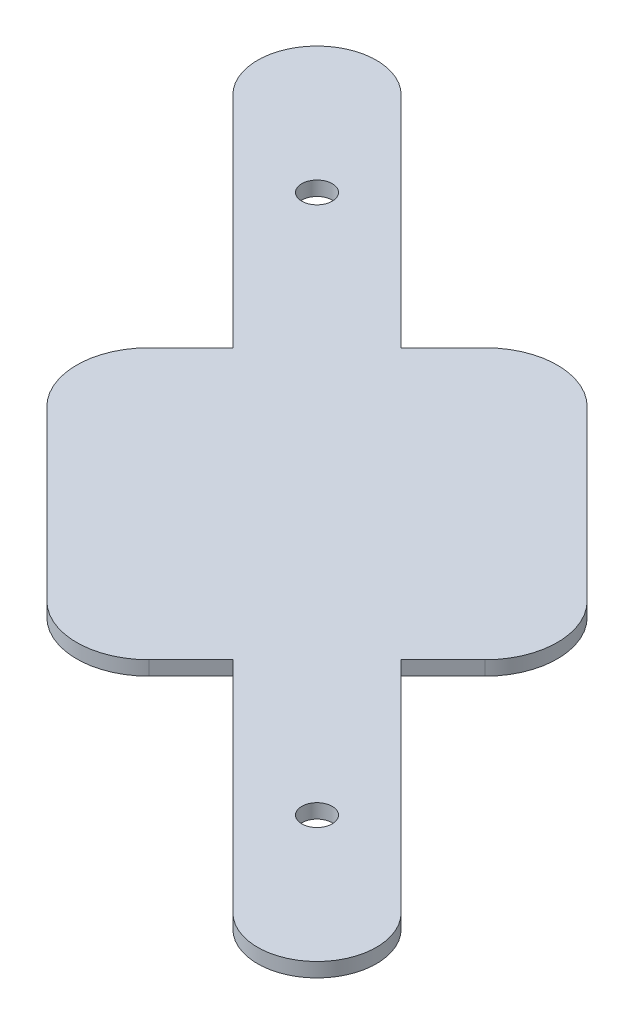
ISO-10303-21;
HEADER;
FILE_DESCRIPTION(('STEP AP214'),'2;1');
FILE_NAME('part.step','',(''),(''),'','','');
FILE_SCHEMA(('AUTOMOTIVE_DESIGN { 1 0 10303 214 1 1 1 1 }'));
ENDSEC;
DATA;
#1=APPLICATION_CONTEXT('core data for automotive mechanical design processes');
#2=APPLICATION_PROTOCOL_DEFINITION('international standard','automotive_design',2000,#1);
#3=PRODUCT_CONTEXT('',#1,'mechanical');
#4=PRODUCT('Part','Part','',(#3));
#5=PRODUCT_RELATED_PRODUCT_CATEGORY('part','',(#4));
#6=PRODUCT_DEFINITION_FORMATION('','',#4);
#7=PRODUCT_DEFINITION_CONTEXT('part definition',#1,'design');
#8=PRODUCT_DEFINITION('design','',#6,#7);
#9=PRODUCT_DEFINITION_SHAPE('','',#8);
#10=(LENGTH_UNIT() NAMED_UNIT(*) SI_UNIT(.MILLI.,.METRE.));
#11=(NAMED_UNIT(*) PLANE_ANGLE_UNIT() SI_UNIT($,.RADIAN.));
#12=(NAMED_UNIT(*) SI_UNIT($,.STERADIAN.) SOLID_ANGLE_UNIT());
#13=UNCERTAINTY_MEASURE_WITH_UNIT(LENGTH_MEASURE(1.E-05),#10,'distance_accuracy_value','');
#14=(GEOMETRIC_REPRESENTATION_CONTEXT(3) GLOBAL_UNCERTAINTY_ASSIGNED_CONTEXT((#13)) GLOBAL_UNIT_ASSIGNED_CONTEXT((#10,
#11,#12)) REPRESENTATION_CONTEXT('',''));
#15=CARTESIAN_POINT('',(0.,0.,0.));
#16=DIRECTION('',(0.,0.,1.));
#17=DIRECTION('',(1.,0.,0.));
#18=AXIS2_PLACEMENT_3D('',#15,#16,#17);
#19=CARTESIAN_POINT('',(-28.3968528922178,3.,-28.3968528922178));
#20=DIRECTION('',(-0.707106781186548,0.,-0.707106781186547));
#21=DIRECTION('',(-0.707106781186547,0.,0.707106781186548));
#22=AXIS2_PLACEMENT_3D('',#19,#20,#21);
#23=PLANE('',#22);
#24=DIRECTION('',(0.707106781186547,0.,-0.707106781186548));
#25=VECTOR('',#24,1.);
#26=CARTESIAN_POINT('',(-28.3968528922178,0.,-28.3968528922178));
#27=LINE('',#26,#25);
#28=CARTESIAN_POINT('',(-46.0745224218814,0.,-10.7191833625541));
#29=VERTEX_POINT('',#28);
#30=CARTESIAN_POINT('',(-37.2356876570496,0.,-19.5580181273859));
#31=VERTEX_POINT('',#30);
#32=EDGE_CURVE('E182',#29,#31,#27,.T.);
#33=ORIENTED_EDGE('',*,*,#32,.F.);
#34=DIRECTION('',(0.,-1.,0.));
#35=VECTOR('',#34,1.);
#36=CARTESIAN_POINT('',(-46.0745224218814,3.,-10.7191833625541));
#37=LINE('',#36,#35);
#38=CARTESIAN_POINT('',(-46.0745224218814,3.,-10.7191833625541));
#39=VERTEX_POINT('',#38);
#40=EDGE_CURVE('E11',#39,#29,#37,.T.);
#41=ORIENTED_EDGE('',*,*,#40,.F.);
#42=DIRECTION('',(0.707106781186547,0.,-0.707106781186548));
#43=VECTOR('',#42,1.);
#44=CARTESIAN_POINT('',(-28.3968528922178,3.,-28.3968528922178));
#45=LINE('',#44,#43);
#46=CARTESIAN_POINT('',(-37.2356876570496,3.,-19.5580181273859));
#47=VERTEX_POINT('',#46);
#48=EDGE_CURVE('E515',#39,#47,#45,.T.);
#49=ORIENTED_EDGE('',*,*,#48,.T.);
#50=DIRECTION('',(0.,-1.,0.));
#51=VECTOR('',#50,1.);
#52=CARTESIAN_POINT('',(-37.2356876570496,3.,-19.5580181273859));
#53=LINE('',#52,#51);
#54=EDGE_CURVE('E49',#47,#31,#53,.T.);
#55=ORIENTED_EDGE('',*,*,#54,.T.);
#56=EDGE_LOOP('',(#33,#41,#49,#55));
#57=FACE_BOUND('',#56,.T.);
#58=ADVANCED_FACE('F32',(#57),#23,.T.);
#59=CARTESIAN_POINT('',(-35.3553390593273,3.,0.));
#60=DIRECTION('',(0.,-1.,0.));
#61=DIRECTION('',(0.,0.,-1.));
#62=AXIS2_PLACEMENT_3D('',#59,#60,#61);
#63=CYLINDRICAL_SURFACE('',#62,15.159214488888);
#64=CARTESIAN_POINT('',(-35.3553390593273,0.,0.));
#65=DIRECTION('',(0.,1.,0.));
#66=DIRECTION('',(0.,0.,1.));
#67=AXIS2_PLACEMENT_3D('',#64,#65,#66);
#68=CIRCLE('',#67,15.159214488888);
#69=CARTESIAN_POINT('',(-46.0745224218814,0.,10.7191833625541));
#70=VERTEX_POINT('',#69);
#71=EDGE_CURVE('E184',#29,#70,#68,.T.);
#72=ORIENTED_EDGE('',*,*,#71,.T.);
#73=DIRECTION('',(0.,-1.,0.));
#74=VECTOR('',#73,1.);
#75=CARTESIAN_POINT('',(-46.0745224218814,3.,10.7191833625541));
#76=LINE('',#75,#74);
#77=CARTESIAN_POINT('',(-46.0745224218814,3.,10.7191833625541));
#78=VERTEX_POINT('',#77);
#79=EDGE_CURVE('E41',#78,#70,#76,.T.);
#80=ORIENTED_EDGE('',*,*,#79,.F.);
#81=CARTESIAN_POINT('',(-35.3553390593273,3.,0.));
#82=DIRECTION('',(0.,1.,0.));
#83=DIRECTION('',(0.,0.,1.));
#84=AXIS2_PLACEMENT_3D('',#81,#82,#83);
#85=CIRCLE('',#84,15.159214488888);
#86=EDGE_CURVE('E482',#39,#78,#85,.T.);
#87=ORIENTED_EDGE('',*,*,#86,.F.);
#88=ORIENTED_EDGE('',*,*,#40,.T.);
#89=EDGE_LOOP('',(#72,#80,#87,#88));
#90=FACE_BOUND('',#89,.T.);
#91=ADVANCED_FACE('F262',(#90),#63,.T.);
#92=CARTESIAN_POINT('',(-28.3968528922177,3.,28.3968528922178));
#93=DIRECTION('',(0.707106781186547,0.,-0.707106781186548));
#94=DIRECTION('',(-0.707106781186548,0.,-0.707106781186547));
#95=AXIS2_PLACEMENT_3D('',#92,#93,#94);
#96=PLANE('',#95);
#97=DIRECTION('',(0.707106781186548,0.,0.707106781186547));
#98=VECTOR('',#97,1.);
#99=CARTESIAN_POINT('',(-28.3968528922177,0.,28.3968528922178));
#100=LINE('',#99,#98);
#101=CARTESIAN_POINT('',(-10.719183362554,0.,46.0745224218814));
#102=VERTEX_POINT('',#101);
#103=EDGE_CURVE('E187',#70,#102,#100,.T.);
#104=ORIENTED_EDGE('',*,*,#103,.T.);
#105=DIRECTION('',(0.,-1.,0.));
#106=VECTOR('',#105,1.);
#107=CARTESIAN_POINT('',(-10.719183362554,3.,46.0745224218814));
#108=LINE('',#107,#106);
#109=CARTESIAN_POINT('',(-10.719183362554,3.,46.0745224218814));
#110=VERTEX_POINT('',#109);
#111=EDGE_CURVE('E250',#110,#102,#108,.T.);
#112=ORIENTED_EDGE('',*,*,#111,.F.);
#113=DIRECTION('',(0.707106781186548,0.,0.707106781186547));
#114=VECTOR('',#113,1.);
#115=CARTESIAN_POINT('',(-28.3968528922177,3.,28.3968528922178));
#116=LINE('',#115,#114);
#117=EDGE_CURVE('E258',#78,#110,#116,.T.);
#118=ORIENTED_EDGE('',*,*,#117,.F.);
#119=ORIENTED_EDGE('',*,*,#79,.T.);
#120=EDGE_LOOP('',(#104,#112,#118,#119));
#121=FACE_BOUND('',#120,.T.);
#122=ADVANCED_FACE('F255',(#121),#96,.F.);
#123=CARTESIAN_POINT('',(0.,3.,35.3553390593274));
#124=DIRECTION('',(0.,-1.,0.));
#125=DIRECTION('',(0.,0.,-1.));
#126=AXIS2_PLACEMENT_3D('',#123,#124,#125);
#127=CYLINDRICAL_SURFACE('',#126,15.159214488888);
#128=CARTESIAN_POINT('',(0.,0.,35.3553390593274));
#129=DIRECTION('',(0.,1.,0.));
#130=DIRECTION('',(0.,0.,1.));
#131=AXIS2_PLACEMENT_3D('',#128,#129,#130);
#132=CIRCLE('',#131,15.159214488888);
#133=CARTESIAN_POINT('',(10.7191833625541,0.,46.0745224218814));
#134=VERTEX_POINT('',#133);
#135=EDGE_CURVE('E190',#102,#134,#132,.T.);
#136=ORIENTED_EDGE('',*,*,#135,.T.);
#137=DIRECTION('',(0.,-1.,0.));
#138=VECTOR('',#137,1.);
#139=CARTESIAN_POINT('',(10.7191833625541,3.,46.0745224218814));
#140=LINE('',#139,#138);
#141=CARTESIAN_POINT('',(10.7191833625541,3.,46.0745224218814));
#142=VERTEX_POINT('',#141);
#143=EDGE_CURVE('E247',#142,#134,#140,.T.);
#144=ORIENTED_EDGE('',*,*,#143,.F.);
#145=CARTESIAN_POINT('',(0.,3.,35.3553390593274));
#146=DIRECTION('',(0.,1.,0.));
#147=DIRECTION('',(0.,0.,1.));
#148=AXIS2_PLACEMENT_3D('',#145,#146,#147);
#149=CIRCLE('',#148,15.159214488888);
#150=EDGE_CURVE('E479',#110,#142,#149,.T.);
#151=ORIENTED_EDGE('',*,*,#150,.F.);
#152=ORIENTED_EDGE('',*,*,#111,.T.);
#153=EDGE_LOOP('',(#136,#144,#151,#152));
#154=FACE_BOUND('',#153,.T.);
#155=ADVANCED_FACE('F337',(#154),#127,.T.);
#156=CARTESIAN_POINT('',(28.3968528922177,3.,28.3968528922178));
#157=DIRECTION('',(-0.707106781186547,0.,-0.707106781186548));
#158=DIRECTION('',(-0.707106781186548,0.,0.707106781186547));
#159=AXIS2_PLACEMENT_3D('',#156,#157,#158);
#160=PLANE('',#159);
#161=DIRECTION('',(0.707106781186548,0.,-0.707106781186547));
#162=VECTOR('',#161,1.);
#163=CARTESIAN_POINT('',(28.3968528922177,0.,28.3968528922178));
#164=LINE('',#163,#162);
#165=CARTESIAN_POINT('',(19.5580181273861,0.,37.2356876570494));
#166=VERTEX_POINT('',#165);
#167=EDGE_CURVE('E193',#134,#166,#164,.T.);
#168=ORIENTED_EDGE('',*,*,#167,.T.);
#169=DIRECTION('',(0.,-1.,0.));
#170=VECTOR('',#169,1.);
#171=CARTESIAN_POINT('',(19.5580181273861,3.,37.2356876570494));
#172=LINE('',#171,#170);
#173=CARTESIAN_POINT('',(19.5580181273861,3.,37.2356876570494));
#174=VERTEX_POINT('',#173);
#175=EDGE_CURVE('E245',#174,#166,#172,.T.);
#176=ORIENTED_EDGE('',*,*,#175,.F.);
#177=DIRECTION('',(0.707106781186548,0.,-0.707106781186547));
#178=VECTOR('',#177,1.);
#179=CARTESIAN_POINT('',(28.3968528922177,3.,28.3968528922178));
#180=LINE('',#179,#178);
#181=EDGE_CURVE('E474',#142,#174,#180,.T.);
#182=ORIENTED_EDGE('',*,*,#181,.F.);
#183=ORIENTED_EDGE('',*,*,#143,.T.);
#184=EDGE_LOOP('',(#168,#176,#182,#183));
#185=FACE_BOUND('',#184,.T.);
#186=ADVANCED_FACE('F333',(#185),#160,.F.);
#187=CARTESIAN_POINT('',(-8.83883476483176,3.,8.83883476483183));
#188=DIRECTION('',(-0.707106781186545,0.,0.70710678118655));
#189=DIRECTION('',(0.70710678118655,0.,0.707106781186545));
#190=AXIS2_PLACEMENT_3D('',#187,#188,#189);
#191=PLANE('',#190);
#192=DIRECTION('',(-0.70710678118655,0.,-0.707106781186545));
#193=VECTOR('',#192,1.);
#194=CARTESIAN_POINT('',(-8.83883476483176,0.,8.83883476483183));
#195=LINE('',#194,#193);
#196=CARTESIAN_POINT('',(65.6548646331713,0.,83.3325341628343));
#197=VERTEX_POINT('',#196);
#198=EDGE_CURVE('E196',#197,#166,#195,.T.);
#199=ORIENTED_EDGE('',*,*,#198,.F.);
#200=DIRECTION('',(0.,-1.,0.));
#201=VECTOR('',#200,1.);
#202=CARTESIAN_POINT('',(65.6548646331713,3.,83.3325341628343));
#203=LINE('',#202,#201);
#204=CARTESIAN_POINT('',(65.6548646331713,3.,83.3325341628343));
#205=VERTEX_POINT('',#204);
#206=EDGE_CURVE('E243',#205,#197,#203,.T.);
#207=ORIENTED_EDGE('',*,*,#206,.F.);
#208=DIRECTION('',(-0.70710678118655,0.,-0.707106781186545));
#209=VECTOR('',#208,1.);
#210=CARTESIAN_POINT('',(-8.83883476483176,3.,8.83883476483183));
#211=LINE('',#210,#209);
#212=EDGE_CURVE('E478',#205,#174,#211,.T.);
#213=ORIENTED_EDGE('',*,*,#212,.T.);
#214=ORIENTED_EDGE('',*,*,#175,.T.);
#215=EDGE_LOOP('',(#199,#207,#213,#214));
#216=FACE_BOUND('',#215,.T.);
#217=ADVANCED_FACE('F329',(#216),#191,.T.);
#218=CARTESIAN_POINT('',(74.4936993980031,3.,74.4936993980024));
#219=DIRECTION('',(0.,-1.,0.));
#220=DIRECTION('',(0.,0.,-1.));
#221=AXIS2_PLACEMENT_3D('',#218,#219,#220);
#222=CYLINDRICAL_SURFACE('',#221,12.5000000000002);
#223=CARTESIAN_POINT('',(74.4936993980031,0.,74.4936993980024));
#224=DIRECTION('',(0.,1.,0.));
#225=DIRECTION('',(0.,0.,1.));
#226=AXIS2_PLACEMENT_3D('',#223,#224,#225);
#227=CIRCLE('',#226,12.5000000000002);
#228=CARTESIAN_POINT('',(83.3325341628353,0.,65.6548646331703));
#229=VERTEX_POINT('',#228);
#230=EDGE_CURVE('E199',#229,#197,#227,.F.);
#231=ORIENTED_EDGE('',*,*,#230,.F.);
#232=DIRECTION('',(0.,-1.,0.));
#233=VECTOR('',#232,1.);
#234=CARTESIAN_POINT('',(83.3325341628353,3.,65.6548646331703));
#235=LINE('',#234,#233);
#236=CARTESIAN_POINT('',(83.3325341628353,3.,65.6548646331703));
#237=VERTEX_POINT('',#236);
#238=EDGE_CURVE('E241',#237,#229,#235,.T.);
#239=ORIENTED_EDGE('',*,*,#238,.F.);
#240=CARTESIAN_POINT('',(74.4936993980031,3.,74.4936993980024));
#241=DIRECTION('',(0.,1.,0.));
#242=DIRECTION('',(0.,0.,1.));
#243=AXIS2_PLACEMENT_3D('',#240,#241,#242);
#244=CIRCLE('',#243,12.5000000000002);
#245=EDGE_CURVE('E487',#237,#205,#244,.F.);
#246=ORIENTED_EDGE('',*,*,#245,.T.);
#247=ORIENTED_EDGE('',*,*,#206,.T.);
#248=EDGE_LOOP('',(#231,#239,#246,#247));
#249=FACE_BOUND('',#248,.T.);
#250=ADVANCED_FACE('F325',(#249),#222,.T.);
#251=CARTESIAN_POINT('',(8.83883476482947,3.,-8.83883476483011));
#252=DIRECTION('',(0.707106781186522,0.,-0.707106781186573));
#253=DIRECTION('',(-0.707106781186573,0.,-0.707106781186522));
#254=AXIS2_PLACEMENT_3D('',#251,#252,#253);
#255=PLANE('',#254);
#256=DIRECTION('',(0.707106781186573,0.,0.707106781186522));
#257=VECTOR('',#256,1.);
#258=CARTESIAN_POINT('',(8.83883476482947,0.,-8.83883476483011));
#259=LINE('',#258,#257);
#260=CARTESIAN_POINT('',(37.2356876570497,0.,19.5580181273856));
#261=VERTEX_POINT('',#260);
#262=EDGE_CURVE('E202',#261,#229,#259,.T.);
#263=ORIENTED_EDGE('',*,*,#262,.F.);
#264=DIRECTION('',(0.,-1.,0.));
#265=VECTOR('',#264,1.);
#266=CARTESIAN_POINT('',(37.2356876570497,3.,19.5580181273856));
#267=LINE('',#266,#265);
#268=CARTESIAN_POINT('',(37.2356876570497,3.,19.5580181273856));
#269=VERTEX_POINT('',#268);
#270=EDGE_CURVE('E239',#269,#261,#267,.T.);
#271=ORIENTED_EDGE('',*,*,#270,.F.);
#272=DIRECTION('',(0.707106781186573,0.,0.707106781186522));
#273=VECTOR('',#272,1.);
#274=CARTESIAN_POINT('',(8.83883476482947,3.,-8.83883476483011));
#275=LINE('',#274,#273);
#276=EDGE_CURVE('E490',#269,#237,#275,.T.);
#277=ORIENTED_EDGE('',*,*,#276,.T.);
#278=ORIENTED_EDGE('',*,*,#238,.T.);
#279=EDGE_LOOP('',(#263,#271,#277,#278));
#280=FACE_BOUND('',#279,.T.);
#281=ADVANCED_FACE('F321',(#280),#255,.T.);
#282=CARTESIAN_POINT('',(28.3968528922174,3.,28.3968528922178));
#283=DIRECTION('',(-0.707106781186542,0.,-0.707106781186553));
#284=DIRECTION('',(-0.707106781186553,0.,0.707106781186542));
#285=AXIS2_PLACEMENT_3D('',#282,#283,#284);
#286=PLANE('',#285);
#287=DIRECTION('',(0.707106781186553,0.,-0.707106781186542));
#288=VECTOR('',#287,1.);
#289=CARTESIAN_POINT('',(28.3968528922174,0.,28.3968528922178));
#290=LINE('',#289,#288);
#291=CARTESIAN_POINT('',(46.0745224218814,0.,10.719183362554));
#292=VERTEX_POINT('',#291);
#293=EDGE_CURVE('E205',#261,#292,#290,.T.);
#294=ORIENTED_EDGE('',*,*,#293,.T.);
#295=DIRECTION('',(0.,-1.,0.));
#296=VECTOR('',#295,1.);
#297=CARTESIAN_POINT('',(46.0745224218814,3.,10.719183362554));
#298=LINE('',#297,#296);
#299=CARTESIAN_POINT('',(46.0745224218814,3.,10.719183362554));
#300=VERTEX_POINT('',#299);
#301=EDGE_CURVE('E236',#300,#292,#298,.T.);
#302=ORIENTED_EDGE('',*,*,#301,.F.);
#303=DIRECTION('',(0.707106781186553,0.,-0.707106781186542));
#304=VECTOR('',#303,1.);
#305=CARTESIAN_POINT('',(28.3968528922174,3.,28.3968528922178));
#306=LINE('',#305,#304);
#307=EDGE_CURVE('E493',#269,#300,#306,.T.);
#308=ORIENTED_EDGE('',*,*,#307,.F.);
#309=ORIENTED_EDGE('',*,*,#270,.T.);
#310=EDGE_LOOP('',(#294,#302,#308,#309));
#311=FACE_BOUND('',#310,.T.);
#312=ADVANCED_FACE('F317',(#311),#286,.F.);
#313=CARTESIAN_POINT('',(35.3553390593274,3.,0.));
#314=DIRECTION('',(0.,-1.,0.));
#315=DIRECTION('',(0.,0.,-1.));
#316=AXIS2_PLACEMENT_3D('',#313,#314,#315);
#317=CYLINDRICAL_SURFACE('',#316,15.159214488888);
#318=CARTESIAN_POINT('',(35.3553390593274,0.,0.));
#319=DIRECTION('',(0.,1.,0.));
#320=DIRECTION('',(0.,0.,1.));
#321=AXIS2_PLACEMENT_3D('',#318,#319,#320);
#322=CIRCLE('',#321,15.159214488888);
#323=CARTESIAN_POINT('',(46.0745224218814,0.,-10.7191833625541));
#324=VERTEX_POINT('',#323);
#325=EDGE_CURVE('E208',#292,#324,#322,.T.);
#326=ORIENTED_EDGE('',*,*,#325,.T.);
#327=DIRECTION('',(0.,-1.,0.));
#328=VECTOR('',#327,1.);
#329=CARTESIAN_POINT('',(46.0745224218814,3.,-10.7191833625541));
#330=LINE('',#329,#328);
#331=CARTESIAN_POINT('',(46.0745224218814,3.,-10.7191833625541));
#332=VERTEX_POINT('',#331);
#333=EDGE_CURVE('E234',#332,#324,#330,.T.);
#334=ORIENTED_EDGE('',*,*,#333,.F.);
#335=CARTESIAN_POINT('',(35.3553390593274,3.,0.));
#336=DIRECTION('',(0.,1.,0.));
#337=DIRECTION('',(0.,0.,1.));
#338=AXIS2_PLACEMENT_3D('',#335,#336,#337);
#339=CIRCLE('',#338,15.159214488888);
#340=EDGE_CURVE('E496',#300,#332,#339,.T.);
#341=ORIENTED_EDGE('',*,*,#340,.F.);
#342=ORIENTED_EDGE('',*,*,#301,.T.);
#343=EDGE_LOOP('',(#326,#334,#341,#342));
#344=FACE_BOUND('',#343,.T.);
#345=ADVANCED_FACE('F313',(#344),#317,.T.);
#346=CARTESIAN_POINT('',(28.3968528922177,3.,-28.3968528922177));
#347=DIRECTION('',(0.707106781186547,0.,-0.707106781186548));
#348=DIRECTION('',(-0.707106781186548,0.,-0.707106781186547));
#349=AXIS2_PLACEMENT_3D('',#346,#347,#348);
#350=PLANE('',#349);
#351=DIRECTION('',(0.707106781186548,0.,0.707106781186547));
#352=VECTOR('',#351,1.);
#353=CARTESIAN_POINT('',(28.3968528922177,0.,-28.3968528922177));
#354=LINE('',#353,#352);
#355=CARTESIAN_POINT('',(10.719183362554,0.,-46.0745224218814));
#356=VERTEX_POINT('',#355);
#357=EDGE_CURVE('E211',#356,#324,#354,.T.);
#358=ORIENTED_EDGE('',*,*,#357,.F.);
#359=DIRECTION('',(0.,-1.,0.));
#360=VECTOR('',#359,1.);
#361=CARTESIAN_POINT('',(10.719183362554,3.,-46.0745224218814));
#362=LINE('',#361,#360);
#363=CARTESIAN_POINT('',(10.719183362554,3.,-46.0745224218814));
#364=VERTEX_POINT('',#363);
#365=EDGE_CURVE('E232',#364,#356,#362,.T.);
#366=ORIENTED_EDGE('',*,*,#365,.F.);
#367=DIRECTION('',(0.707106781186548,0.,0.707106781186547));
#368=VECTOR('',#367,1.);
#369=CARTESIAN_POINT('',(28.3968528922177,3.,-28.3968528922177));
#370=LINE('',#369,#368);
#371=EDGE_CURVE('E498',#364,#332,#370,.T.);
#372=ORIENTED_EDGE('',*,*,#371,.T.);
#373=ORIENTED_EDGE('',*,*,#333,.T.);
#374=EDGE_LOOP('',(#358,#366,#372,#373));
#375=FACE_BOUND('',#374,.T.);
#376=ADVANCED_FACE('F309',(#375),#350,.T.);
#377=CARTESIAN_POINT('',(0.,3.,-35.3553390593274));
#378=DIRECTION('',(0.,-1.,0.));
#379=DIRECTION('',(0.,0.,-1.));
#380=AXIS2_PLACEMENT_3D('',#377,#378,#379);
#381=CYLINDRICAL_SURFACE('',#380,15.159214488888);
#382=CARTESIAN_POINT('',(0.,0.,-35.3553390593274));
#383=DIRECTION('',(0.,1.,0.));
#384=DIRECTION('',(0.,0.,1.));
#385=AXIS2_PLACEMENT_3D('',#382,#383,#384);
#386=CIRCLE('',#385,15.159214488888);
#387=CARTESIAN_POINT('',(-10.7191833625541,0.,-46.0745224218814));
#388=VERTEX_POINT('',#387);
#389=EDGE_CURVE('E214',#356,#388,#386,.T.);
#390=ORIENTED_EDGE('',*,*,#389,.T.);
#391=DIRECTION('',(0.,-1.,0.));
#392=VECTOR('',#391,1.);
#393=CARTESIAN_POINT('',(-10.7191833625541,3.,-46.0745224218814));
#394=LINE('',#393,#392);
#395=CARTESIAN_POINT('',(-10.7191833625541,3.,-46.0745224218814));
#396=VERTEX_POINT('',#395);
#397=EDGE_CURVE('E230',#396,#388,#394,.T.);
#398=ORIENTED_EDGE('',*,*,#397,.F.);
#399=CARTESIAN_POINT('',(0.,3.,-35.3553390593274));
#400=DIRECTION('',(0.,1.,0.));
#401=DIRECTION('',(0.,0.,1.));
#402=AXIS2_PLACEMENT_3D('',#399,#400,#401);
#403=CIRCLE('',#402,15.159214488888);
#404=EDGE_CURVE('E171',#364,#396,#403,.T.);
#405=ORIENTED_EDGE('',*,*,#404,.F.);
#406=ORIENTED_EDGE('',*,*,#365,.T.);
#407=EDGE_LOOP('',(#390,#398,#405,#406));
#408=FACE_BOUND('',#407,.T.);
#409=ADVANCED_FACE('F305',(#408),#381,.T.);
#410=CARTESIAN_POINT('',(-28.3968528922177,3.,-28.3968528922177));
#411=DIRECTION('',(-0.707106781186547,0.,-0.707106781186548));
#412=DIRECTION('',(-0.707106781186548,0.,0.707106781186547));
#413=AXIS2_PLACEMENT_3D('',#410,#411,#412);
#414=PLANE('',#413);
#415=DIRECTION('',(0.707106781186548,0.,-0.707106781186547));
#416=VECTOR('',#415,1.);
#417=CARTESIAN_POINT('',(-28.3968528922177,0.,-28.3968528922177));
#418=LINE('',#417,#416);
#419=CARTESIAN_POINT('',(-19.5580181273859,0.,-37.2356876570496));
#420=VERTEX_POINT('',#419);
#421=EDGE_CURVE('E217',#420,#388,#418,.T.);
#422=ORIENTED_EDGE('',*,*,#421,.F.);
#423=DIRECTION('',(0.,-1.,0.));
#424=VECTOR('',#423,1.);
#425=CARTESIAN_POINT('',(-19.5580181273859,3.,-37.2356876570496));
#426=LINE('',#425,#424);
#427=CARTESIAN_POINT('',(-19.5580181273859,3.,-37.2356876570496));
#428=VERTEX_POINT('',#427);
#429=EDGE_CURVE('E157',#428,#420,#426,.T.);
#430=ORIENTED_EDGE('',*,*,#429,.F.);
#431=DIRECTION('',(0.707106781186548,0.,-0.707106781186547));
#432=VECTOR('',#431,1.);
#433=CARTESIAN_POINT('',(-28.3968528922177,3.,-28.3968528922177));
#434=LINE('',#433,#432);
#435=EDGE_CURVE('E169',#428,#396,#434,.T.);
#436=ORIENTED_EDGE('',*,*,#435,.T.);
#437=ORIENTED_EDGE('',*,*,#397,.T.);
#438=EDGE_LOOP('',(#422,#430,#436,#437));
#439=FACE_BOUND('',#438,.T.);
#440=ADVANCED_FACE('F302',(#439),#414,.T.);
#441=CARTESIAN_POINT('',(8.83883476483184,3.,-8.83883476483184));
#442=DIRECTION('',(0.707106781186547,0.,-0.707106781186547));
#443=DIRECTION('',(-0.707106781186548,0.,-0.707106781186548));
#444=AXIS2_PLACEMENT_3D('',#441,#442,#443);
#445=PLANE('',#444);
#446=DIRECTION('',(0.707106781186548,0.,0.707106781186548));
#447=VECTOR('',#446,1.);
#448=CARTESIAN_POINT('',(8.83883476483184,0.,-8.83883476483184));
#449=LINE('',#448,#447);
#450=CARTESIAN_POINT('',(-65.6548646331707,0.,-83.332534162835));
#451=VERTEX_POINT('',#450);
#452=EDGE_CURVE('E154',#451,#420,#449,.T.);
#453=ORIENTED_EDGE('',*,*,#452,.F.);
#454=DIRECTION('',(0.,-1.,0.));
#455=VECTOR('',#454,1.);
#456=CARTESIAN_POINT('',(-65.6548646331707,3.,-83.332534162835));
#457=LINE('',#456,#455);
#458=CARTESIAN_POINT('',(-65.6548646331707,3.,-83.332534162835));
#459=VERTEX_POINT('',#458);
#460=EDGE_CURVE('E148',#459,#451,#457,.T.);
#461=ORIENTED_EDGE('',*,*,#460,.F.);
#462=DIRECTION('',(0.707106781186548,0.,0.707106781186548));
#463=VECTOR('',#462,1.);
#464=CARTESIAN_POINT('',(8.83883476483184,3.,-8.83883476483184));
#465=LINE('',#464,#463);
#466=EDGE_CURVE('E152',#459,#428,#465,.T.);
#467=ORIENTED_EDGE('',*,*,#466,.T.);
#468=ORIENTED_EDGE('',*,*,#429,.T.);
#469=EDGE_LOOP('',(#453,#461,#467,#468));
#470=FACE_BOUND('',#469,.T.);
#471=ADVANCED_FACE('F150',(#470),#445,.T.);
#472=CARTESIAN_POINT('',(-74.4936993980028,3.,-74.4936993980028));
#473=DIRECTION('',(0.,-1.,0.));
#474=DIRECTION('',(0.,0.,-1.));
#475=AXIS2_PLACEMENT_3D('',#472,#473,#474);
#476=CYLINDRICAL_SURFACE('',#475,12.5000000000002);
#477=CARTESIAN_POINT('',(-74.4936993980028,0.,-74.4936993980028));
#478=DIRECTION('',(0.,1.,0.));
#479=DIRECTION('',(0.,0.,1.));
#480=AXIS2_PLACEMENT_3D('',#477,#478,#479);
#481=CIRCLE('',#480,12.5000000000002);
#482=CARTESIAN_POINT('',(-83.3325341628346,0.,-65.654864633171));
#483=VERTEX_POINT('',#482);
#484=EDGE_CURVE('E221',#451,#483,#481,.T.);
#485=ORIENTED_EDGE('',*,*,#484,.T.);
#486=DIRECTION('',(0.,-1.,0.));
#487=VECTOR('',#486,1.);
#488=CARTESIAN_POINT('',(-83.3325341628346,3.,-65.654864633171));
#489=LINE('',#488,#487);
#490=CARTESIAN_POINT('',(-83.3325341628346,3.,-65.654864633171));
#491=VERTEX_POINT('',#490);
#492=EDGE_CURVE('E99',#491,#483,#489,.T.);
#493=ORIENTED_EDGE('',*,*,#492,.F.);
#494=CARTESIAN_POINT('',(-74.4936993980028,3.,-74.4936993980028));
#495=DIRECTION('',(0.,1.,0.));
#496=DIRECTION('',(0.,0.,1.));
#497=AXIS2_PLACEMENT_3D('',#494,#495,#496);
#498=CIRCLE('',#497,12.5000000000002);
#499=EDGE_CURVE('E159',#459,#491,#498,.T.);
#500=ORIENTED_EDGE('',*,*,#499,.F.);
#501=ORIENTED_EDGE('',*,*,#460,.T.);
#502=EDGE_LOOP('',(#485,#493,#500,#501));
#503=FACE_BOUND('',#502,.T.);
#504=ADVANCED_FACE('F160',(#503),#476,.T.);
#505=CARTESIAN_POINT('',(-56.6746085121018,3.,-56.6746085121018));
#506=DIRECTION('',(0.,-1.,0.));
#507=DIRECTION('',(0.,0.,-1.));
#508=AXIS2_PLACEMENT_3D('',#505,#506,#507);
#509=CYLINDRICAL_SURFACE('',#508,3.2);
#510=CARTESIAN_POINT('',(-56.6746085121018,3.,-56.6746085121018));
#511=DIRECTION('',(0.,1.,0.));
#512=DIRECTION('',(0.,0.,1.));
#513=AXIS2_PLACEMENT_3D('',#510,#511,#512);
#514=CIRCLE('',#513,3.2);
#515=CARTESIAN_POINT('',(-56.6746085121018,3.,-53.4746085121018));
#516=VERTEX_POINT('',#515);
#517=EDGE_CURVE('E285',#516,#516,#514,.T.);
#518=ORIENTED_EDGE('',*,*,#517,.T.);
#519=EDGE_LOOP('',(#518));
#520=FACE_BOUND('',#519,.T.);
#521=CARTESIAN_POINT('',(-56.6746085121018,0.,-56.6746085121018));
#522=DIRECTION('',(0.,1.,0.));
#523=DIRECTION('',(0.,0.,1.));
#524=AXIS2_PLACEMENT_3D('',#521,#522,#523);
#525=CIRCLE('',#524,3.2);
#526=CARTESIAN_POINT('',(-56.6746085121018,0.,-53.4746085121018));
#527=VERTEX_POINT('',#526);
#528=EDGE_CURVE('E179',#527,#527,#525,.T.);
#529=ORIENTED_EDGE('',*,*,#528,.F.);
#530=EDGE_LOOP('',(#529));
#531=FACE_BOUND('',#530,.T.);
#532=ADVANCED_FACE('F272',(#520,#531),#509,.F.);
#533=CARTESIAN_POINT('',(56.6746085121018,3.,56.6746085121018));
#534=DIRECTION('',(0.,-1.,0.));
#535=DIRECTION('',(0.,0.,-1.));
#536=AXIS2_PLACEMENT_3D('',#533,#534,#535);
#537=CYLINDRICAL_SURFACE('',#536,3.20000000000034);
#538=CARTESIAN_POINT('',(56.6746085121018,3.,56.6746085121018));
#539=DIRECTION('',(0.,1.,0.));
#540=DIRECTION('',(0.,0.,1.));
#541=AXIS2_PLACEMENT_3D('',#538,#539,#540);
#542=CIRCLE('',#541,3.20000000000034);
#543=CARTESIAN_POINT('',(56.6746085121018,3.,59.8746085121021));
#544=VERTEX_POINT('',#543);
#545=EDGE_CURVE('E226',#544,#544,#542,.F.);
#546=ORIENTED_EDGE('',*,*,#545,.F.);
#547=EDGE_LOOP('',(#546));
#548=FACE_BOUND('',#547,.T.);
#549=CARTESIAN_POINT('',(56.6746085121018,0.,56.6746085121018));
#550=DIRECTION('',(0.,1.,0.));
#551=DIRECTION('',(0.,0.,1.));
#552=AXIS2_PLACEMENT_3D('',#549,#550,#551);
#553=CIRCLE('',#552,3.20000000000034);
#554=CARTESIAN_POINT('',(56.6746085121018,0.,59.8746085121021));
#555=VERTEX_POINT('',#554);
#556=EDGE_CURVE('E176',#555,#555,#553,.F.);
#557=ORIENTED_EDGE('',*,*,#556,.T.);
#558=EDGE_LOOP('',(#557));
#559=FACE_BOUND('',#558,.T.);
#560=ADVANCED_FACE('F34',(#548,#559),#537,.F.);
#561=CARTESIAN_POINT('',(-8.8388347648318,3.,8.83883476483181));
#562=DIRECTION('',(-0.707106781186547,0.,0.707106781186548));
#563=DIRECTION('',(0.707106781186548,0.,0.707106781186547));
#564=AXIS2_PLACEMENT_3D('',#561,#562,#563);
#565=PLANE('',#564);
#566=DIRECTION('',(-0.707106781186548,0.,-0.707106781186547));
#567=VECTOR('',#566,1.);
#568=CARTESIAN_POINT('',(-8.8388347648318,0.,8.83883476483181));
#569=LINE('',#568,#567);
#570=EDGE_CURVE('E223',#31,#483,#569,.T.);
#571=ORIENTED_EDGE('',*,*,#570,.F.);
#572=ORIENTED_EDGE('',*,*,#54,.F.);
#573=DIRECTION('',(-0.707106781186548,0.,-0.707106781186547));
#574=VECTOR('',#573,1.);
#575=CARTESIAN_POINT('',(-8.8388347648318,3.,8.83883476483181));
#576=LINE('',#575,#574);
#577=EDGE_CURVE('E163',#47,#491,#576,.T.);
#578=ORIENTED_EDGE('',*,*,#577,.T.);
#579=ORIENTED_EDGE('',*,*,#492,.T.);
#580=EDGE_LOOP('',(#571,#572,#578,#579));
#581=FACE_BOUND('',#580,.T.);
#582=ADVANCED_FACE('F279',(#581),#565,.T.);
#583=CARTESIAN_POINT('',(0.,3.,0.));
#584=DIRECTION('',(0.,1.,0.));
#585=DIRECTION('',(0.,0.,1.));
#586=AXIS2_PLACEMENT_3D('',#583,#584,#585);
#587=PLANE('',#586);
#588=ORIENTED_EDGE('',*,*,#545,.T.);
#589=EDGE_LOOP('',(#588));
#590=FACE_BOUND('',#589,.T.);
#591=ORIENTED_EDGE('',*,*,#517,.F.);
#592=EDGE_LOOP('',(#591));
#593=FACE_BOUND('',#592,.T.);
#594=ORIENTED_EDGE('',*,*,#48,.F.);
#595=ORIENTED_EDGE('',*,*,#86,.T.);
#596=ORIENTED_EDGE('',*,*,#117,.T.);
#597=ORIENTED_EDGE('',*,*,#150,.T.);
#598=ORIENTED_EDGE('',*,*,#181,.T.);
#599=ORIENTED_EDGE('',*,*,#212,.F.);
#600=ORIENTED_EDGE('',*,*,#245,.F.);
#601=ORIENTED_EDGE('',*,*,#276,.F.);
#602=ORIENTED_EDGE('',*,*,#307,.T.);
#603=ORIENTED_EDGE('',*,*,#340,.T.);
#604=ORIENTED_EDGE('',*,*,#371,.F.);
#605=ORIENTED_EDGE('',*,*,#404,.T.);
#606=ORIENTED_EDGE('',*,*,#435,.F.);
#607=ORIENTED_EDGE('',*,*,#466,.F.);
#608=ORIENTED_EDGE('',*,*,#499,.T.);
#609=ORIENTED_EDGE('',*,*,#577,.F.);
#610=EDGE_LOOP('',(#594,#595,#596,#597,#598,#599,#600,#601,#602,#603,#604,#605,#606,#607,#608,#609));
#611=FACE_BOUND('',#610,.T.);
#612=ADVANCED_FACE('F167',(#590,#593,#611),#587,.T.);
#613=CARTESIAN_POINT('',(0.,0.,0.));
#614=DIRECTION('',(0.,1.,0.));
#615=DIRECTION('',(0.,0.,1.));
#616=AXIS2_PLACEMENT_3D('',#613,#614,#615);
#617=PLANE('',#616);
#618=ORIENTED_EDGE('',*,*,#556,.F.);
#619=EDGE_LOOP('',(#618));
#620=FACE_BOUND('',#619,.T.);
#621=ORIENTED_EDGE('',*,*,#528,.T.);
#622=EDGE_LOOP('',(#621));
#623=FACE_BOUND('',#622,.T.);
#624=ORIENTED_EDGE('',*,*,#32,.T.);
#625=ORIENTED_EDGE('',*,*,#570,.T.);
#626=ORIENTED_EDGE('',*,*,#484,.F.);
#627=ORIENTED_EDGE('',*,*,#452,.T.);
#628=ORIENTED_EDGE('',*,*,#421,.T.);
#629=ORIENTED_EDGE('',*,*,#389,.F.);
#630=ORIENTED_EDGE('',*,*,#357,.T.);
#631=ORIENTED_EDGE('',*,*,#325,.F.);
#632=ORIENTED_EDGE('',*,*,#293,.F.);
#633=ORIENTED_EDGE('',*,*,#262,.T.);
#634=ORIENTED_EDGE('',*,*,#230,.T.);
#635=ORIENTED_EDGE('',*,*,#198,.T.);
#636=ORIENTED_EDGE('',*,*,#167,.F.);
#637=ORIENTED_EDGE('',*,*,#135,.F.);
#638=ORIENTED_EDGE('',*,*,#103,.F.);
#639=ORIENTED_EDGE('',*,*,#71,.F.);
#640=EDGE_LOOP('',(#624,#625,#626,#627,#628,#629,#630,#631,#632,#633,#634,#635,#636,#637,#638,#639));
#641=FACE_BOUND('',#640,.T.);
#642=ADVANCED_FACE('F264',(#620,#623,#641),#617,.F.);
#643=CLOSED_SHELL('',(#58,#91,#122,#155,#186,#217,#250,#281,#312,#345,#376,#409,#440,#471,#504,
#532,#560,#582,#612,#642));
#644=MANIFOLD_SOLID_BREP('B2',#643);
#645=ADVANCED_BREP_SHAPE_REPRESENTATION('',(#18,#644),#14);
#646=SHAPE_DEFINITION_REPRESENTATION(#9,#645);
ENDSEC;
END-ISO-10303-21;
